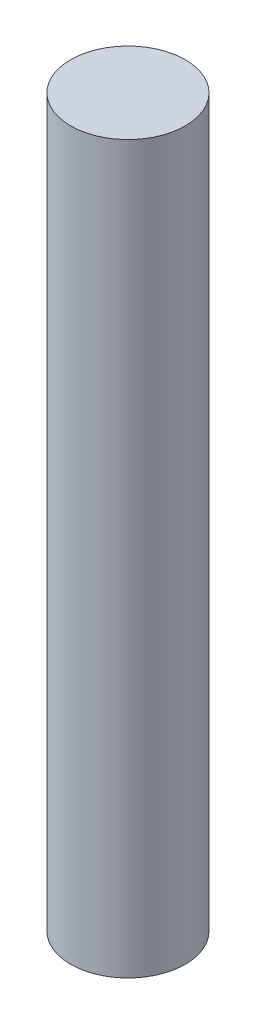
ISO-10303-21;
HEADER;
FILE_DESCRIPTION(('STEP AP214'),'2;1');
FILE_NAME('part.step','',(''),(''),'','','');
FILE_SCHEMA(('AUTOMOTIVE_DESIGN { 1 0 10303 214 1 1 1 1 }'));
ENDSEC;
DATA;
#1=APPLICATION_CONTEXT('core data for automotive mechanical design processes');
#2=APPLICATION_PROTOCOL_DEFINITION('international standard','automotive_design',2000,#1);
#3=PRODUCT_CONTEXT('',#1,'mechanical');
#4=PRODUCT('Part','Part','',(#3));
#5=PRODUCT_RELATED_PRODUCT_CATEGORY('part','',(#4));
#6=PRODUCT_DEFINITION_FORMATION('','',#4);
#7=PRODUCT_DEFINITION_CONTEXT('part definition',#1,'design');
#8=PRODUCT_DEFINITION('design','',#6,#7);
#9=PRODUCT_DEFINITION_SHAPE('','',#8);
#10=(LENGTH_UNIT() NAMED_UNIT(*) SI_UNIT(.MILLI.,.METRE.));
#11=(NAMED_UNIT(*) PLANE_ANGLE_UNIT() SI_UNIT($,.RADIAN.));
#12=(NAMED_UNIT(*) SI_UNIT($,.STERADIAN.) SOLID_ANGLE_UNIT());
#13=UNCERTAINTY_MEASURE_WITH_UNIT(LENGTH_MEASURE(1.E-05),#10,'distance_accuracy_value','');
#14=(GEOMETRIC_REPRESENTATION_CONTEXT(3) GLOBAL_UNCERTAINTY_ASSIGNED_CONTEXT((#13)) GLOBAL_UNIT_ASSIGNED_CONTEXT((#10,
#11,#12)) REPRESENTATION_CONTEXT('',''));
#15=CARTESIAN_POINT('',(0.,0.,0.));
#16=DIRECTION('',(0.,0.,1.));
#17=DIRECTION('',(1.,0.,0.));
#18=AXIS2_PLACEMENT_3D('',#15,#16,#17);
#19=CARTESIAN_POINT('',(0.,19.,0.));
#20=DIRECTION('',(0.,-1.,0.));
#21=DIRECTION('',(0.,0.,-1.));
#22=AXIS2_PLACEMENT_3D('',#19,#20,#21);
#23=CYLINDRICAL_SURFACE('',#22,1.5);
#24=CARTESIAN_POINT('',(0.,19.,0.));
#25=DIRECTION('',(0.,1.,0.));
#26=DIRECTION('',(0.,0.,1.));
#27=AXIS2_PLACEMENT_3D('',#24,#25,#26);
#28=CIRCLE('',#27,1.5);
#29=CARTESIAN_POINT('',(0.,19.,1.5));
#30=VERTEX_POINT('',#29);
#31=EDGE_CURVE('E10',#30,#30,#28,.T.);
#32=ORIENTED_EDGE('',*,*,#31,.F.);
#33=EDGE_LOOP('',(#32));
#34=FACE_BOUND('',#33,.T.);
#35=CARTESIAN_POINT('',(0.,0.,0.));
#36=DIRECTION('',(0.,1.,0.));
#37=DIRECTION('',(0.,0.,1.));
#38=AXIS2_PLACEMENT_3D('',#35,#36,#37);
#39=CIRCLE('',#38,1.5);
#40=CARTESIAN_POINT('',(0.,0.,1.5));
#41=VERTEX_POINT('',#40);
#42=EDGE_CURVE('E36',#41,#41,#39,.T.);
#43=ORIENTED_EDGE('',*,*,#42,.T.);
#44=EDGE_LOOP('',(#43));
#45=FACE_BOUND('',#44,.T.);
#46=ADVANCED_FACE('F33',(#34,#45),#23,.T.);
#47=CARTESIAN_POINT('',(0.,19.,0.));
#48=DIRECTION('',(0.,1.,0.));
#49=DIRECTION('',(0.,0.,1.));
#50=AXIS2_PLACEMENT_3D('',#47,#48,#49);
#51=PLANE('',#50);
#52=ORIENTED_EDGE('',*,*,#31,.T.);
#53=EDGE_LOOP('',(#52));
#54=FACE_BOUND('',#53,.T.);
#55=ADVANCED_FACE('F48',(#54),#51,.T.);
#56=CARTESIAN_POINT('',(0.,0.,0.));
#57=DIRECTION('',(0.,1.,0.));
#58=DIRECTION('',(0.,0.,1.));
#59=AXIS2_PLACEMENT_3D('',#56,#57,#58);
#60=PLANE('',#59);
#61=ORIENTED_EDGE('',*,*,#42,.F.);
#62=EDGE_LOOP('',(#61));
#63=FACE_BOUND('',#62,.T.);
#64=ADVANCED_FACE('F46',(#63),#60,.F.);
#65=CLOSED_SHELL('',(#46,#55,#64));
#66=MANIFOLD_SOLID_BREP('B2',#65);
#67=ADVANCED_BREP_SHAPE_REPRESENTATION('',(#18,#66),#14);
#68=SHAPE_DEFINITION_REPRESENTATION(#9,#67);
ENDSEC;
END-ISO-10303-21;
